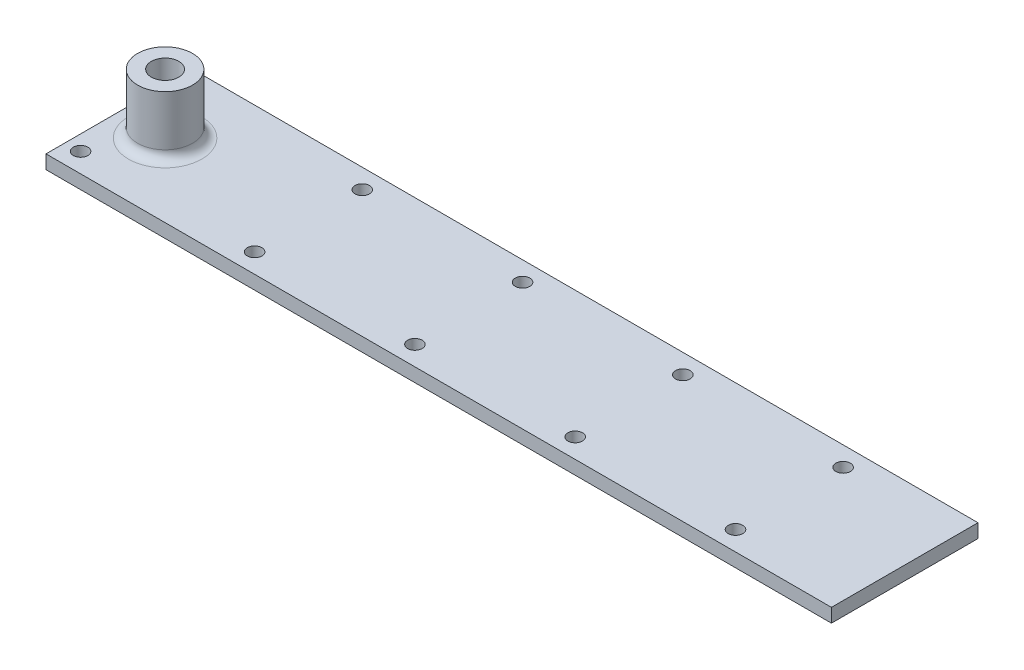
ISO-10303-21;
HEADER;
FILE_DESCRIPTION(('STEP AP214'),'2;1');
FILE_NAME('part.step','',(''),(''),'','','');
FILE_SCHEMA(('AUTOMOTIVE_DESIGN { 1 0 10303 214 1 1 1 1 }'));
ENDSEC;
DATA;
#1=APPLICATION_CONTEXT('core data for automotive mechanical design processes');
#2=APPLICATION_PROTOCOL_DEFINITION('international standard','automotive_design',2000,#1);
#3=PRODUCT_CONTEXT('',#1,'mechanical');
#4=PRODUCT('Part','Part','',(#3));
#5=PRODUCT_RELATED_PRODUCT_CATEGORY('part','',(#4));
#6=PRODUCT_DEFINITION_FORMATION('','',#4);
#7=PRODUCT_DEFINITION_CONTEXT('part definition',#1,'design');
#8=PRODUCT_DEFINITION('design','',#6,#7);
#9=PRODUCT_DEFINITION_SHAPE('','',#8);
#10=(LENGTH_UNIT() NAMED_UNIT(*) SI_UNIT(.MILLI.,.METRE.));
#11=(NAMED_UNIT(*) PLANE_ANGLE_UNIT() SI_UNIT($,.RADIAN.));
#12=(NAMED_UNIT(*) SI_UNIT($,.STERADIAN.) SOLID_ANGLE_UNIT());
#13=UNCERTAINTY_MEASURE_WITH_UNIT(LENGTH_MEASURE(1.E-05),#10,'distance_accuracy_value','');
#14=(GEOMETRIC_REPRESENTATION_CONTEXT(3) GLOBAL_UNCERTAINTY_ASSIGNED_CONTEXT((#13)) GLOBAL_UNIT_ASSIGNED_CONTEXT((#10,
#11,#12)) REPRESENTATION_CONTEXT('',''));
#15=CARTESIAN_POINT('',(0.,0.,0.));
#16=DIRECTION('',(0.,0.,1.));
#17=DIRECTION('',(1.,0.,0.));
#18=AXIS2_PLACEMENT_3D('',#15,#16,#17);
#19=CARTESIAN_POINT('',(0.,-13.,0.));
#20=DIRECTION('',(0.,1.,0.));
#21=DIRECTION('',(0.,0.,1.));
#22=AXIS2_PLACEMENT_3D('',#19,#20,#21);
#23=CYLINDRICAL_SURFACE('',#22,3.);
#24=CARTESIAN_POINT('',(0.,0.,0.));
#25=DIRECTION('',(0.,1.,0.));
#26=DIRECTION('',(0.,0.,1.));
#27=AXIS2_PLACEMENT_3D('',#24,#25,#26);
#28=CIRCLE('',#27,3.);
#29=CARTESIAN_POINT('',(0.,0.,3.));
#30=VERTEX_POINT('',#29);
#31=EDGE_CURVE('E376',#30,#30,#28,.T.);
#32=ORIENTED_EDGE('',*,*,#31,.T.);
#33=EDGE_LOOP('',(#32));
#34=FACE_BOUND('',#33,.T.);
#35=DIRECTION('',(0.,1.,0.));
#36=VECTOR('',#35,1.);
#37=CARTESIAN_POINT('',(1.5,-13.,2.59807621135332));
#38=LINE('',#37,#36);
#39=CARTESIAN_POINT('',(1.5,-11.3956567872682,2.59807621135332));
#40=VERTEX_POINT('',#39);
#41=CARTESIAN_POINT('',(1.5,-13.,2.59807621135332));
#42=VERTEX_POINT('',#41);
#43=EDGE_CURVE('E52',#40,#42,#38,.F.);
#44=ORIENTED_EDGE('',*,*,#43,.F.);
#45=CARTESIAN_POINT('',(0.,-11.3956567872682,0.));
#46=DIRECTION('',(0.,-1.,0.));
#47=DIRECTION('',(0.,0.,-1.));
#48=AXIS2_PLACEMENT_3D('',#45,#46,#47);
#49=CIRCLE('',#48,3.);
#50=CARTESIAN_POINT('',(0.,-11.3956567872682,3.00000000000001));
#51=VERTEX_POINT('',#50);
#52=EDGE_CURVE('E402',#51,#40,#49,.F.);
#53=ORIENTED_EDGE('',*,*,#52,.F.);
#54=CARTESIAN_POINT('',(-1.5,-11.3956567872682,2.59807621135332));
#55=VERTEX_POINT('',#54);
#56=EDGE_CURVE('E407',#55,#51,#49,.F.);
#57=ORIENTED_EDGE('',*,*,#56,.F.);
#58=DIRECTION('',(0.,1.,0.));
#59=VECTOR('',#58,1.);
#60=CARTESIAN_POINT('',(-1.5,-13.,2.59807621135332));
#61=LINE('',#60,#59);
#62=CARTESIAN_POINT('',(-1.5,-13.,2.59807621135332));
#63=VERTEX_POINT('',#62);
#64=EDGE_CURVE('E67',#55,#63,#61,.F.);
#65=ORIENTED_EDGE('',*,*,#64,.T.);
#66=CARTESIAN_POINT('',(0.,-13.,0.));
#67=DIRECTION('',(0.,1.,0.));
#68=DIRECTION('',(0.,0.,1.));
#69=AXIS2_PLACEMENT_3D('',#66,#67,#68);
#70=CIRCLE('',#69,3.);
#71=CARTESIAN_POINT('',(-1.5,-13.,-2.59807621135332));
#72=VERTEX_POINT('',#71);
#73=EDGE_CURVE('E387',#72,#63,#70,.T.);
#74=ORIENTED_EDGE('',*,*,#73,.F.);
#75=DIRECTION('',(0.,1.,0.));
#76=VECTOR('',#75,1.);
#77=CARTESIAN_POINT('',(-1.5,-13.,-2.59807621135332));
#78=LINE('',#77,#76);
#79=CARTESIAN_POINT('',(-1.5,-11.3956567872682,-2.59807621135332));
#80=VERTEX_POINT('',#79);
#81=EDGE_CURVE('E394',#72,#80,#78,.T.);
#82=ORIENTED_EDGE('',*,*,#81,.T.);
#83=CARTESIAN_POINT('',(0.,-11.3956567872682,-3.));
#84=VERTEX_POINT('',#83);
#85=EDGE_CURVE('E398',#84,#80,#49,.F.);
#86=ORIENTED_EDGE('',*,*,#85,.F.);
#87=CARTESIAN_POINT('',(1.5,-11.3956567872682,-2.59807621135332));
#88=VERTEX_POINT('',#87);
#89=EDGE_CURVE('E401',#88,#84,#49,.F.);
#90=ORIENTED_EDGE('',*,*,#89,.F.);
#91=DIRECTION('',(0.,1.,0.));
#92=VECTOR('',#91,1.);
#93=CARTESIAN_POINT('',(1.5,-13.,-2.59807621135332));
#94=LINE('',#93,#92);
#95=CARTESIAN_POINT('',(1.5,-13.,-2.59807621135332));
#96=VERTEX_POINT('',#95);
#97=EDGE_CURVE('E403',#96,#88,#94,.T.);
#98=ORIENTED_EDGE('',*,*,#97,.F.);
#99=EDGE_CURVE('E382',#42,#96,#70,.T.);
#100=ORIENTED_EDGE('',*,*,#99,.F.);
#101=EDGE_LOOP('',(#44,#53,#57,#65,#74,#82,#86,#90,#98,#100));
#102=FACE_BOUND('',#101,.T.);
#103=ADVANCED_FACE('F43',(#34,#102),#23,.F.);
#104=CARTESIAN_POINT('',(0.,-13.,0.));
#105=DIRECTION('',(0.,1.,0.));
#106=DIRECTION('',(0.,0.,1.));
#107=AXIS2_PLACEMENT_3D('',#104,#105,#106);
#108=CYLINDRICAL_SURFACE('',#107,6.);
#109=CARTESIAN_POINT('',(0.,-11.,0.));
#110=DIRECTION('',(0.,1.,0.));
#111=DIRECTION('',(0.,0.,1.));
#112=AXIS2_PLACEMENT_3D('',#109,#110,#111);
#113=CIRCLE('',#112,6.);
#114=CARTESIAN_POINT('',(0.,-11.,6.00000000000001));
#115=VERTEX_POINT('',#114);
#116=EDGE_CURVE('E11',#115,#115,#113,.F.);
#117=ORIENTED_EDGE('',*,*,#116,.F.);
#118=EDGE_LOOP('',(#117));
#119=FACE_BOUND('',#118,.T.);
#120=CARTESIAN_POINT('',(0.,0.,0.));
#121=DIRECTION('',(0.,1.,0.));
#122=DIRECTION('',(0.,0.,1.));
#123=AXIS2_PLACEMENT_3D('',#120,#121,#122);
#124=CIRCLE('',#123,6.);
#125=CARTESIAN_POINT('',(0.,0.,6.));
#126=VERTEX_POINT('',#125);
#127=EDGE_CURVE('E386',#126,#126,#124,.T.);
#128=ORIENTED_EDGE('',*,*,#127,.F.);
#129=EDGE_LOOP('',(#128));
#130=FACE_BOUND('',#129,.T.);
#131=ADVANCED_FACE('F45',(#119,#130),#108,.T.);
#132=CARTESIAN_POINT('',(0.,0.,0.));
#133=DIRECTION('',(0.,1.,0.));
#134=DIRECTION('',(0.,0.,1.));
#135=AXIS2_PLACEMENT_3D('',#132,#133,#134);
#136=PLANE('',#135);
#137=ORIENTED_EDGE('',*,*,#31,.F.);
#138=EDGE_LOOP('',(#137));
#139=FACE_BOUND('',#138,.T.);
#140=ORIENTED_EDGE('',*,*,#127,.T.);
#141=EDGE_LOOP('',(#140));
#142=FACE_BOUND('',#141,.T.);
#143=ADVANCED_FACE('F539',(#139,#142),#136,.T.);
#144=CARTESIAN_POINT('',(1.5,-11.3956567872682,0.));
#145=DIRECTION('',(0.,-1.,0.));
#146=DIRECTION('',(0.,0.,-1.));
#147=AXIS2_PLACEMENT_3D('',#144,#145,#146);
#148=PLANE('',#147);
#149=ORIENTED_EDGE('',*,*,#85,.T.);
#150=DIRECTION('',(0.,0.,1.));
#151=VECTOR('',#150,1.);
#152=CARTESIAN_POINT('',(-1.5,-11.3956567872682,0.));
#153=LINE('',#152,#151);
#154=CARTESIAN_POINT('',(-1.5,-11.3956567872682,-3.));
#155=VERTEX_POINT('',#154);
#156=EDGE_CURVE('E59',#155,#80,#153,.T.);
#157=ORIENTED_EDGE('',*,*,#156,.F.);
#158=DIRECTION('',(-1.,0.,0.));
#159=VECTOR('',#158,1.);
#160=CARTESIAN_POINT('',(1.5,-11.3956567872682,-3.));
#161=LINE('',#160,#159);
#162=EDGE_CURVE('E377',#84,#155,#161,.T.);
#163=ORIENTED_EDGE('',*,*,#162,.F.);
#164=EDGE_LOOP('',(#149,#157,#163));
#165=FACE_BOUND('',#164,.T.);
#166=ADVANCED_FACE('F428',(#165),#148,.T.);
#167=ORIENTED_EDGE('',*,*,#89,.T.);
#168=CARTESIAN_POINT('',(1.5,-11.3956567872682,-3.));
#169=VERTEX_POINT('',#168);
#170=EDGE_CURVE('E372',#169,#84,#161,.T.);
#171=ORIENTED_EDGE('',*,*,#170,.F.);
#172=DIRECTION('',(0.,0.,1.));
#173=VECTOR('',#172,1.);
#174=CARTESIAN_POINT('',(1.5,-11.3956567872682,0.));
#175=LINE('',#174,#173);
#176=EDGE_CURVE('E356',#169,#88,#175,.T.);
#177=ORIENTED_EDGE('',*,*,#176,.T.);
#178=EDGE_LOOP('',(#167,#171,#177));
#179=FACE_BOUND('',#178,.T.);
#180=ADVANCED_FACE('F424',(#179),#148,.T.);
#181=CARTESIAN_POINT('',(1.5,-11.3956567872682,-5.));
#182=DIRECTION('',(-1.,0.,0.));
#183=DIRECTION('',(0.,0.,1.));
#184=AXIS2_PLACEMENT_3D('',#181,#182,#183);
#185=CYLINDRICAL_SURFACE('',#184,2.);
#186=CARTESIAN_POINT('',(1.5,-11.3956567872682,-5.));
#187=DIRECTION('',(-1.,0.,0.));
#188=DIRECTION('',(0.,0.,1.));
#189=AXIS2_PLACEMENT_3D('',#186,#187,#188);
#190=CIRCLE('',#189,2.);
#191=CARTESIAN_POINT('',(1.5,-13.3480309076362,-4.5661390843627));
#192=VERTEX_POINT('',#191);
#193=EDGE_CURVE('E360',#169,#192,#190,.F.);
#194=ORIENTED_EDGE('',*,*,#193,.F.);
#195=ORIENTED_EDGE('',*,*,#170,.T.);
#196=ORIENTED_EDGE('',*,*,#162,.T.);
#197=CARTESIAN_POINT('',(-1.5,-11.3956567872682,-5.));
#198=DIRECTION('',(-1.,0.,0.));
#199=DIRECTION('',(0.,0.,1.));
#200=AXIS2_PLACEMENT_3D('',#197,#198,#199);
#201=CIRCLE('',#200,2.);
#202=CARTESIAN_POINT('',(-1.5,-13.3480309076362,-4.5661390843627));
#203=VERTEX_POINT('',#202);
#204=EDGE_CURVE('E355',#155,#203,#201,.F.);
#205=ORIENTED_EDGE('',*,*,#204,.T.);
#206=DIRECTION('',(-1.,0.,0.));
#207=VECTOR('',#206,1.);
#208=CARTESIAN_POINT('',(1.5,-13.3480309076362,-4.5661390843627));
#209=LINE('',#208,#207);
#210=EDGE_CURVE('E451',#192,#203,#209,.T.);
#211=ORIENTED_EDGE('',*,*,#210,.F.);
#212=EDGE_LOOP('',(#194,#195,#196,#205,#211));
#213=FACE_BOUND('',#212,.T.);
#214=ADVANCED_FACE('F432',(#213),#185,.T.);
#215=CARTESIAN_POINT('',(1.5,-11.3956567872682,5.));
#216=DIRECTION('',(-1.,0.,0.));
#217=DIRECTION('',(0.,0.,1.));
#218=AXIS2_PLACEMENT_3D('',#215,#216,#217);
#219=CYLINDRICAL_SURFACE('',#218,1.99999999999999);
#220=CARTESIAN_POINT('',(-1.5,-11.3956567872682,5.));
#221=DIRECTION('',(-1.,0.,0.));
#222=DIRECTION('',(0.,0.,1.));
#223=AXIS2_PLACEMENT_3D('',#220,#221,#222);
#224=CIRCLE('',#223,1.99999999999999);
#225=CARTESIAN_POINT('',(-1.5,-13.3480309076361,4.56613908436271));
#226=VERTEX_POINT('',#225);
#227=CARTESIAN_POINT('',(-1.5,-11.3956567872682,3.00000000000001));
#228=VERTEX_POINT('',#227);
#229=EDGE_CURVE('E350',#226,#228,#224,.F.);
#230=ORIENTED_EDGE('',*,*,#229,.T.);
#231=DIRECTION('',(-1.,0.,0.));
#232=VECTOR('',#231,1.);
#233=CARTESIAN_POINT('',(1.5,-11.3956567872682,3.00000000000001));
#234=LINE('',#233,#232);
#235=EDGE_CURVE('E363',#51,#228,#234,.T.);
#236=ORIENTED_EDGE('',*,*,#235,.F.);
#237=CARTESIAN_POINT('',(1.5,-11.3956567872682,3.00000000000001));
#238=VERTEX_POINT('',#237);
#239=EDGE_CURVE('E378',#238,#51,#234,.T.);
#240=ORIENTED_EDGE('',*,*,#239,.F.);
#241=CARTESIAN_POINT('',(1.5,-11.3956567872682,5.));
#242=DIRECTION('',(-1.,0.,0.));
#243=DIRECTION('',(0.,0.,1.));
#244=AXIS2_PLACEMENT_3D('',#241,#242,#243);
#245=CIRCLE('',#244,1.99999999999999);
#246=CARTESIAN_POINT('',(1.5,-13.3480309076361,4.56613908436271));
#247=VERTEX_POINT('',#246);
#248=EDGE_CURVE('E351',#247,#238,#245,.F.);
#249=ORIENTED_EDGE('',*,*,#248,.F.);
#250=DIRECTION('',(-1.,0.,0.));
#251=VECTOR('',#250,1.);
#252=CARTESIAN_POINT('',(1.5,-13.3480309076361,4.56613908436271));
#253=LINE('',#252,#251);
#254=EDGE_CURVE('E455',#247,#226,#253,.T.);
#255=ORIENTED_EDGE('',*,*,#254,.T.);
#256=EDGE_LOOP('',(#230,#236,#240,#249,#255));
#257=FACE_BOUND('',#256,.T.);
#258=ADVANCED_FACE('F505',(#257),#219,.T.);
#259=ORIENTED_EDGE('',*,*,#56,.T.);
#260=ORIENTED_EDGE('',*,*,#235,.T.);
#261=EDGE_CURVE('E367',#55,#228,#153,.T.);
#262=ORIENTED_EDGE('',*,*,#261,.F.);
#263=EDGE_LOOP('',(#259,#260,#262));
#264=FACE_BOUND('',#263,.T.);
#265=ADVANCED_FACE('F555',(#264),#148,.T.);
#266=ORIENTED_EDGE('',*,*,#52,.T.);
#267=EDGE_CURVE('E354',#40,#238,#175,.T.);
#268=ORIENTED_EDGE('',*,*,#267,.T.);
#269=ORIENTED_EDGE('',*,*,#239,.T.);
#270=EDGE_LOOP('',(#266,#268,#269));
#271=FACE_BOUND('',#270,.T.);
#272=ADVANCED_FACE('F507',(#271),#148,.T.);
#273=CARTESIAN_POINT('',(1.5,0.,0.));
#274=DIRECTION('',(-1.,0.,0.));
#275=DIRECTION('',(0.,0.,1.));
#276=AXIS2_PLACEMENT_3D('',#273,#274,#275);
#277=PLANE('',#276);
#278=ORIENTED_EDGE('',*,*,#43,.T.);
#279=DIRECTION('',(0.,0.,-1.));
#280=VECTOR('',#279,1.);
#281=CARTESIAN_POINT('',(1.5,-13.,0.));
#282=LINE('',#281,#280);
#283=EDGE_CURVE('E342',#42,#96,#282,.T.);
#284=ORIENTED_EDGE('',*,*,#283,.T.);
#285=ORIENTED_EDGE('',*,*,#97,.T.);
#286=ORIENTED_EDGE('',*,*,#176,.F.);
#287=ORIENTED_EDGE('',*,*,#193,.T.);
#288=DIRECTION('',(0.,-0.216930457818655,-0.976187060183953));
#289=VECTOR('',#288,1.);
#290=CARTESIAN_POINT('',(1.5,-11.7529411764706,2.61176470588234));
#291=LINE('',#290,#289);
#292=CARTESIAN_POINT('',(1.5,-13.6519690923638,-5.93386091563729));
#293=VERTEX_POINT('',#292);
#294=EDGE_CURVE('E490',#192,#293,#291,.T.);
#295=ORIENTED_EDGE('',*,*,#294,.T.);
#296=CARTESIAN_POINT('',(1.5,-15.6043432127317,-5.49999999999999));
#297=DIRECTION('',(-1.,0.,0.));
#298=DIRECTION('',(0.,0.,1.));
#299=AXIS2_PLACEMENT_3D('',#296,#297,#298);
#300=CIRCLE('',#299,2.);
#301=CARTESIAN_POINT('',(1.5,-15.6043432127318,-7.49999999999999));
#302=VERTEX_POINT('',#301);
#303=EDGE_CURVE('E211',#293,#302,#300,.T.);
#304=ORIENTED_EDGE('',*,*,#303,.T.);
#305=DIRECTION('',(0.,-1.,0.));
#306=VECTOR('',#305,1.);
#307=CARTESIAN_POINT('',(1.5,0.,-7.50000000000002));
#308=LINE('',#307,#306);
#309=CARTESIAN_POINT('',(1.5,-16.,-7.49999999999999));
#310=VERTEX_POINT('',#309);
#311=EDGE_CURVE('E197',#302,#310,#308,.T.);
#312=ORIENTED_EDGE('',*,*,#311,.T.);
#313=DIRECTION('',(0.,0.,1.));
#314=VECTOR('',#313,1.);
#315=CARTESIAN_POINT('',(1.5,-16.,0.));
#316=LINE('',#315,#314);
#317=CARTESIAN_POINT('',(1.5,-16.,7.50000000000001));
#318=VERTEX_POINT('',#317);
#319=EDGE_CURVE('E190',#310,#318,#316,.T.);
#320=ORIENTED_EDGE('',*,*,#319,.T.);
#321=DIRECTION('',(0.,-1.,0.));
#322=VECTOR('',#321,1.);
#323=CARTESIAN_POINT('',(1.5,0.,7.49999999999997));
#324=LINE('',#323,#322);
#325=CARTESIAN_POINT('',(1.5,-15.6043432127317,7.50000000000001));
#326=VERTEX_POINT('',#325);
#327=EDGE_CURVE('E177',#326,#318,#324,.T.);
#328=ORIENTED_EDGE('',*,*,#327,.F.);
#329=CARTESIAN_POINT('',(1.5,-15.6043432127317,5.50000000000001));
#330=DIRECTION('',(-1.,0.,0.));
#331=DIRECTION('',(0.,0.,1.));
#332=AXIS2_PLACEMENT_3D('',#329,#330,#331);
#333=CIRCLE('',#332,2.);
#334=CARTESIAN_POINT('',(1.5,-13.6519690923638,5.93386091563732));
#335=VERTEX_POINT('',#334);
#336=EDGE_CURVE('E189',#326,#335,#333,.T.);
#337=ORIENTED_EDGE('',*,*,#336,.T.);
#338=DIRECTION('',(0.,-0.216930457818655,0.976187060183953));
#339=VECTOR('',#338,1.);
#340=CARTESIAN_POINT('',(1.5,-11.7529411764706,-2.61176470588234));
#341=LINE('',#340,#339);
#342=EDGE_CURVE('E494',#247,#335,#341,.T.);
#343=ORIENTED_EDGE('',*,*,#342,.F.);
#344=ORIENTED_EDGE('',*,*,#248,.T.);
#345=ORIENTED_EDGE('',*,*,#267,.F.);
#346=EDGE_LOOP('',(#278,#284,#285,#286,#287,#295,#304,#312,#320,#328,#337,#343,#344,#345));
#347=FACE_BOUND('',#346,.T.);
#348=ADVANCED_FACE('F194',(#347),#277,.T.);
#349=CARTESIAN_POINT('',(-1.5,0.,0.));
#350=DIRECTION('',(-1.,0.,0.));
#351=DIRECTION('',(0.,0.,1.));
#352=AXIS2_PLACEMENT_3D('',#349,#350,#351);
#353=PLANE('',#352);
#354=ORIENTED_EDGE('',*,*,#64,.F.);
#355=ORIENTED_EDGE('',*,*,#261,.T.);
#356=ORIENTED_EDGE('',*,*,#229,.F.);
#357=DIRECTION('',(0.,-0.216930457818655,0.976187060183953));
#358=VECTOR('',#357,1.);
#359=CARTESIAN_POINT('',(-1.5,-11.7529411764706,-2.61176470588234));
#360=LINE('',#359,#358);
#361=CARTESIAN_POINT('',(-1.5,-13.6519690923638,5.93386091563732));
#362=VERTEX_POINT('',#361);
#363=EDGE_CURVE('E476',#226,#362,#360,.T.);
#364=ORIENTED_EDGE('',*,*,#363,.T.);
#365=CARTESIAN_POINT('',(-1.5,-15.6043432127317,5.50000000000001));
#366=DIRECTION('',(-1.,0.,0.));
#367=DIRECTION('',(0.,0.,1.));
#368=AXIS2_PLACEMENT_3D('',#365,#366,#367);
#369=CIRCLE('',#368,2.);
#370=CARTESIAN_POINT('',(-1.5,-15.6043432127317,7.50000000000001));
#371=VERTEX_POINT('',#370);
#372=EDGE_CURVE('E479',#371,#362,#369,.T.);
#373=ORIENTED_EDGE('',*,*,#372,.F.);
#374=DIRECTION('',(0.,-1.,0.));
#375=VECTOR('',#374,1.);
#376=CARTESIAN_POINT('',(-1.5,0.,7.49999999999997));
#377=LINE('',#376,#375);
#378=CARTESIAN_POINT('',(-1.5,-16.,7.50000000000001));
#379=VERTEX_POINT('',#378);
#380=EDGE_CURVE('E483',#371,#379,#377,.T.);
#381=ORIENTED_EDGE('',*,*,#380,.T.);
#382=DIRECTION('',(0.,0.,1.));
#383=VECTOR('',#382,1.);
#384=CARTESIAN_POINT('',(-1.5,-16.,0.));
#385=LINE('',#384,#383);
#386=CARTESIAN_POINT('',(-1.5,-16.,-7.49999999999999));
#387=VERTEX_POINT('',#386);
#388=EDGE_CURVE('E204',#387,#379,#385,.T.);
#389=ORIENTED_EDGE('',*,*,#388,.F.);
#390=DIRECTION('',(0.,-1.,0.));
#391=VECTOR('',#390,1.);
#392=CARTESIAN_POINT('',(-1.5,0.,-7.50000000000002));
#393=LINE('',#392,#391);
#394=CARTESIAN_POINT('',(-1.5,-15.6043432127318,-7.49999999999999));
#395=VERTEX_POINT('',#394);
#396=EDGE_CURVE('E201',#395,#387,#393,.T.);
#397=ORIENTED_EDGE('',*,*,#396,.F.);
#398=CARTESIAN_POINT('',(-1.5,-15.6043432127317,-5.49999999999999));
#399=DIRECTION('',(-1.,0.,0.));
#400=DIRECTION('',(0.,0.,1.));
#401=AXIS2_PLACEMENT_3D('',#398,#399,#400);
#402=CIRCLE('',#401,2.);
#403=CARTESIAN_POINT('',(-1.5,-13.6519690923638,-5.93386091563729));
#404=VERTEX_POINT('',#403);
#405=EDGE_CURVE('E468',#404,#395,#402,.T.);
#406=ORIENTED_EDGE('',*,*,#405,.F.);
#407=DIRECTION('',(0.,-0.216930457818655,-0.976187060183953));
#408=VECTOR('',#407,1.);
#409=CARTESIAN_POINT('',(-1.5,-11.7529411764706,2.61176470588234));
#410=LINE('',#409,#408);
#411=EDGE_CURVE('E472',#203,#404,#410,.T.);
#412=ORIENTED_EDGE('',*,*,#411,.F.);
#413=ORIENTED_EDGE('',*,*,#204,.F.);
#414=ORIENTED_EDGE('',*,*,#156,.T.);
#415=ORIENTED_EDGE('',*,*,#81,.F.);
#416=DIRECTION('',(0.,0.,-1.));
#417=VECTOR('',#416,1.);
#418=CARTESIAN_POINT('',(-1.5,-13.,0.));
#419=LINE('',#418,#417);
#420=EDGE_CURVE('E338',#63,#72,#419,.T.);
#421=ORIENTED_EDGE('',*,*,#420,.F.);
#422=EDGE_LOOP('',(#354,#355,#356,#364,#373,#381,#389,#397,#406,#412,#413,#414,#415,#421));
#423=FACE_BOUND('',#422,.T.);
#424=ADVANCED_FACE('F435',(#423),#353,.F.);
#425=CARTESIAN_POINT('',(0.,-11.,0.));
#426=DIRECTION('',(0.,1.,0.));
#427=DIRECTION('',(0.,0.,1.));
#428=AXIS2_PLACEMENT_3D('',#425,#426,#427);
#429=TOROIDAL_SURFACE('',#428,8.,1.99999999999999);
#430=CARTESIAN_POINT('',(0.,-13.,0.));
#431=DIRECTION('',(0.,1.,0.));
#432=DIRECTION('',(0.,0.,1.));
#433=AXIS2_PLACEMENT_3D('',#430,#431,#432);
#434=CIRCLE('',#433,8.);
#435=CARTESIAN_POINT('',(0.,-13.,8.00000000000001));
#436=VERTEX_POINT('',#435);
#437=EDGE_CURVE('E346',#436,#436,#434,.T.);
#438=ORIENTED_EDGE('',*,*,#437,.T.);
#439=EDGE_LOOP('',(#438));
#440=FACE_BOUND('',#439,.T.);
#441=ORIENTED_EDGE('',*,*,#116,.T.);
#442=EDGE_LOOP('',(#441));
#443=FACE_BOUND('',#442,.T.);
#444=ADVANCED_FACE('F573',(#440,#443),#429,.F.);
#445=CARTESIAN_POINT('',(0.,-13.,0.));
#446=DIRECTION('',(0.,-1.,0.));
#447=DIRECTION('',(0.,0.,-1.));
#448=AXIS2_PLACEMENT_3D('',#445,#446,#447);
#449=PLANE('',#448);
#450=ORIENTED_EDGE('',*,*,#420,.T.);
#451=ORIENTED_EDGE('',*,*,#73,.T.);
#452=EDGE_LOOP('',(#450,#451));
#453=FACE_BOUND('',#452,.T.);
#454=ADVANCED_FACE('F438',(#453),#449,.F.);
#455=ORIENTED_EDGE('',*,*,#283,.F.);
#456=ORIENTED_EDGE('',*,*,#99,.T.);
#457=EDGE_LOOP('',(#455,#456));
#458=FACE_BOUND('',#457,.T.);
#459=ADVANCED_FACE('F510',(#458),#449,.F.);
#460=CARTESIAN_POINT('',(0.,-16.,0.));
#461=DIRECTION('',(0.,-1.,0.));
#462=DIRECTION('',(0.,0.,-1.));
#463=AXIS2_PLACEMENT_3D('',#460,#461,#462);
#464=PLANE('',#463);
#465=CARTESIAN_POINT('',(31.3,-16.,11.75));
#466=DIRECTION('',(0.,-1.,0.));
#467=DIRECTION('',(0.,0.,1.));
#468=AXIS2_PLACEMENT_3D('',#465,#466,#467);
#469=CIRCLE('',#468,1.58749999999998);
#470=CARTESIAN_POINT('',(31.3,-16.,13.3375));
#471=VERTEX_POINT('',#470);
#472=EDGE_CURVE('E225',#471,#471,#469,.T.);
#473=ORIENTED_EDGE('',*,*,#472,.F.);
#474=EDGE_LOOP('',(#473));
#475=FACE_BOUND('',#474,.T.);
#476=CARTESIAN_POINT('',(101.3,-16.,11.75));
#477=DIRECTION('',(0.,-1.,0.));
#478=DIRECTION('',(0.,0.,1.));
#479=AXIS2_PLACEMENT_3D('',#476,#477,#478);
#480=CIRCLE('',#479,1.58749999999998);
#481=CARTESIAN_POINT('',(101.3,-16.,13.3375));
#482=VERTEX_POINT('',#481);
#483=EDGE_CURVE('E241',#482,#482,#480,.T.);
#484=ORIENTED_EDGE('',*,*,#483,.F.);
#485=EDGE_LOOP('',(#484));
#486=FACE_BOUND('',#485,.T.);
#487=CARTESIAN_POINT('',(66.3,-16.,-11.75));
#488=DIRECTION('',(0.,-1.,0.));
#489=DIRECTION('',(0.,0.,-1.));
#490=AXIS2_PLACEMENT_3D('',#487,#488,#489);
#491=CIRCLE('',#490,1.58749999999998);
#492=CARTESIAN_POINT('',(66.3,-16.,-13.3375));
#493=VERTEX_POINT('',#492);
#494=EDGE_CURVE('E257',#493,#493,#491,.T.);
#495=ORIENTED_EDGE('',*,*,#494,.F.);
#496=EDGE_LOOP('',(#495));
#497=FACE_BOUND('',#496,.T.);
#498=CARTESIAN_POINT('',(-6.7,-16.,11.75));
#499=DIRECTION('',(0.,-1.,0.));
#500=DIRECTION('',(0.,0.,-1.));
#501=AXIS2_PLACEMENT_3D('',#498,#499,#500);
#502=CIRCLE('',#501,1.5875);
#503=CARTESIAN_POINT('',(-6.7,-16.,10.1625));
#504=VERTEX_POINT('',#503);
#505=EDGE_CURVE('E273',#504,#504,#502,.T.);
#506=ORIENTED_EDGE('',*,*,#505,.F.);
#507=EDGE_LOOP('',(#506));
#508=FACE_BOUND('',#507,.T.);
#509=CARTESIAN_POINT('',(136.3,-16.,-11.75));
#510=DIRECTION('',(0.,-1.,0.));
#511=DIRECTION('',(0.,0.,-1.));
#512=AXIS2_PLACEMENT_3D('',#509,#510,#511);
#513=CIRCLE('',#512,1.58749999999998);
#514=CARTESIAN_POINT('',(136.3,-16.,-13.3375));
#515=VERTEX_POINT('',#514);
#516=EDGE_CURVE('E289',#515,#515,#513,.T.);
#517=ORIENTED_EDGE('',*,*,#516,.F.);
#518=EDGE_LOOP('',(#517));
#519=FACE_BOUND('',#518,.T.);
#520=DIRECTION('',(0.,0.,-1.));
#521=VECTOR('',#520,1.);
#522=CARTESIAN_POINT('',(-10.,-16.,16.));
#523=LINE('',#522,#521);
#524=CARTESIAN_POINT('',(-10.,-16.,16.));
#525=VERTEX_POINT('',#524);
#526=CARTESIAN_POINT('',(-10.,-16.,-16.));
#527=VERTEX_POINT('',#526);
#528=EDGE_CURVE('E297',#525,#527,#523,.T.);
#529=ORIENTED_EDGE('',*,*,#528,.T.);
#530=DIRECTION('',(1.,0.,0.));
#531=VECTOR('',#530,1.);
#532=CARTESIAN_POINT('',(-10.,-16.,-16.));
#533=LINE('',#532,#531);
#534=CARTESIAN_POINT('',(161.5,-16.,-16.));
#535=VERTEX_POINT('',#534);
#536=EDGE_CURVE('E301',#527,#535,#533,.T.);
#537=ORIENTED_EDGE('',*,*,#536,.T.);
#538=DIRECTION('',(0.,0.,1.));
#539=VECTOR('',#538,1.);
#540=CARTESIAN_POINT('',(161.5,-16.,16.));
#541=LINE('',#540,#539);
#542=CARTESIAN_POINT('',(161.5,-16.,16.));
#543=VERTEX_POINT('',#542);
#544=EDGE_CURVE('E305',#535,#543,#541,.T.);
#545=ORIENTED_EDGE('',*,*,#544,.T.);
#546=DIRECTION('',(-1.,0.,0.));
#547=VECTOR('',#546,1.);
#548=CARTESIAN_POINT('',(-10.,-16.,16.));
#549=LINE('',#548,#547);
#550=EDGE_CURVE('E308',#543,#525,#549,.T.);
#551=ORIENTED_EDGE('',*,*,#550,.T.);
#552=EDGE_LOOP('',(#529,#537,#545,#551));
#553=FACE_BOUND('',#552,.T.);
#554=CARTESIAN_POINT('',(136.3,-16.,11.75));
#555=DIRECTION('',(0.,-1.,0.));
#556=DIRECTION('',(0.,0.,1.));
#557=AXIS2_PLACEMENT_3D('',#554,#555,#556);
#558=CIRCLE('',#557,1.58749999999998);
#559=CARTESIAN_POINT('',(136.3,-16.,13.3375));
#560=VERTEX_POINT('',#559);
#561=EDGE_CURVE('E281',#560,#560,#558,.T.);
#562=ORIENTED_EDGE('',*,*,#561,.F.);
#563=EDGE_LOOP('',(#562));
#564=FACE_BOUND('',#563,.T.);
#565=CARTESIAN_POINT('',(101.3,-16.,-11.75));
#566=DIRECTION('',(0.,-1.,0.));
#567=DIRECTION('',(0.,0.,-1.));
#568=AXIS2_PLACEMENT_3D('',#565,#566,#567);
#569=CIRCLE('',#568,1.58749999999998);
#570=CARTESIAN_POINT('',(101.3,-16.,-13.3375));
#571=VERTEX_POINT('',#570);
#572=EDGE_CURVE('E265',#571,#571,#569,.T.);
#573=ORIENTED_EDGE('',*,*,#572,.F.);
#574=EDGE_LOOP('',(#573));
#575=FACE_BOUND('',#574,.T.);
#576=CARTESIAN_POINT('',(31.3,-16.,-11.75));
#577=DIRECTION('',(0.,-1.,0.));
#578=DIRECTION('',(0.,0.,-1.));
#579=AXIS2_PLACEMENT_3D('',#576,#577,#578);
#580=CIRCLE('',#579,1.58749999999998);
#581=CARTESIAN_POINT('',(31.3,-16.,-13.3375));
#582=VERTEX_POINT('',#581);
#583=EDGE_CURVE('E249',#582,#582,#580,.T.);
#584=ORIENTED_EDGE('',*,*,#583,.F.);
#585=EDGE_LOOP('',(#584));
#586=FACE_BOUND('',#585,.T.);
#587=CARTESIAN_POINT('',(66.3,-16.,11.75));
#588=DIRECTION('',(0.,-1.,0.));
#589=DIRECTION('',(0.,0.,1.));
#590=AXIS2_PLACEMENT_3D('',#587,#588,#589);
#591=CIRCLE('',#590,1.58749999999998);
#592=CARTESIAN_POINT('',(66.3,-16.,13.3375));
#593=VERTEX_POINT('',#592);
#594=EDGE_CURVE('E233',#593,#593,#591,.T.);
#595=ORIENTED_EDGE('',*,*,#594,.F.);
#596=EDGE_LOOP('',(#595));
#597=FACE_BOUND('',#596,.T.);
#598=CARTESIAN_POINT('',(-6.7,-16.,-11.75));
#599=DIRECTION('',(0.,-1.,0.));
#600=DIRECTION('',(0.,0.,1.));
#601=AXIS2_PLACEMENT_3D('',#598,#599,#600);
#602=CIRCLE('',#601,1.5875);
#603=CARTESIAN_POINT('',(-6.7,-16.,-10.1625));
#604=VERTEX_POINT('',#603);
#605=EDGE_CURVE('E215',#604,#604,#602,.T.);
#606=ORIENTED_EDGE('',*,*,#605,.F.);
#607=EDGE_LOOP('',(#606));
#608=FACE_BOUND('',#607,.T.);
#609=DIRECTION('',(-1.,0.,0.));
#610=VECTOR('',#609,1.);
#611=CARTESIAN_POINT('',(1.5,-16.,7.50000000000001));
#612=LINE('',#611,#610);
#613=EDGE_CURVE('E182',#318,#379,#612,.T.);
#614=ORIENTED_EDGE('',*,*,#613,.F.);
#615=ORIENTED_EDGE('',*,*,#319,.F.);
#616=DIRECTION('',(-1.,0.,0.));
#617=VECTOR('',#616,1.);
#618=CARTESIAN_POINT('',(1.5,-16.,-7.49999999999999));
#619=LINE('',#618,#617);
#620=EDGE_CURVE('E224',#310,#387,#619,.T.);
#621=ORIENTED_EDGE('',*,*,#620,.T.);
#622=ORIENTED_EDGE('',*,*,#388,.T.);
#623=EDGE_LOOP('',(#614,#615,#621,#622));
#624=FACE_BOUND('',#623,.T.);
#625=ADVANCED_FACE('F203',(#475,#486,#497,#508,#519,#553,#564,#575,#586,#597,#608,#624),#464,.T.);
#626=ORIENTED_EDGE('',*,*,#437,.F.);
#627=EDGE_LOOP('',(#626));
#628=FACE_BOUND('',#627,.T.);
#629=CARTESIAN_POINT('',(-6.7,-13.,-11.75));
#630=DIRECTION('',(0.,-1.,0.));
#631=DIRECTION('',(0.,0.,1.));
#632=AXIS2_PLACEMENT_3D('',#629,#630,#631);
#633=CIRCLE('',#632,1.5875);
#634=CARTESIAN_POINT('',(-6.7,-13.,-10.1625));
#635=VERTEX_POINT('',#634);
#636=EDGE_CURVE('E220',#635,#635,#633,.T.);
#637=ORIENTED_EDGE('',*,*,#636,.T.);
#638=EDGE_LOOP('',(#637));
#639=FACE_BOUND('',#638,.T.);
#640=CARTESIAN_POINT('',(31.3,-13.,11.75));
#641=DIRECTION('',(0.,-1.,0.));
#642=DIRECTION('',(0.,0.,1.));
#643=AXIS2_PLACEMENT_3D('',#640,#641,#642);
#644=CIRCLE('',#643,1.58749999999998);
#645=CARTESIAN_POINT('',(31.3,-13.,13.3375));
#646=VERTEX_POINT('',#645);
#647=EDGE_CURVE('E219',#646,#646,#644,.T.);
#648=ORIENTED_EDGE('',*,*,#647,.T.);
#649=EDGE_LOOP('',(#648));
#650=FACE_BOUND('',#649,.T.);
#651=CARTESIAN_POINT('',(66.3,-13.,11.75));
#652=DIRECTION('',(0.,-1.,0.));
#653=DIRECTION('',(0.,0.,1.));
#654=AXIS2_PLACEMENT_3D('',#651,#652,#653);
#655=CIRCLE('',#654,1.58749999999998);
#656=CARTESIAN_POINT('',(66.3,-13.,13.3375));
#657=VERTEX_POINT('',#656);
#658=EDGE_CURVE('E229',#657,#657,#655,.T.);
#659=ORIENTED_EDGE('',*,*,#658,.T.);
#660=EDGE_LOOP('',(#659));
#661=FACE_BOUND('',#660,.T.);
#662=CARTESIAN_POINT('',(101.3,-13.,11.75));
#663=DIRECTION('',(0.,-1.,0.));
#664=DIRECTION('',(0.,0.,1.));
#665=AXIS2_PLACEMENT_3D('',#662,#663,#664);
#666=CIRCLE('',#665,1.58749999999998);
#667=CARTESIAN_POINT('',(101.3,-13.,13.3375));
#668=VERTEX_POINT('',#667);
#669=EDGE_CURVE('E237',#668,#668,#666,.T.);
#670=ORIENTED_EDGE('',*,*,#669,.T.);
#671=EDGE_LOOP('',(#670));
#672=FACE_BOUND('',#671,.T.);
#673=CARTESIAN_POINT('',(31.3,-13.,-11.75));
#674=DIRECTION('',(0.,-1.,0.));
#675=DIRECTION('',(0.,0.,-1.));
#676=AXIS2_PLACEMENT_3D('',#673,#674,#675);
#677=CIRCLE('',#676,1.58749999999998);
#678=CARTESIAN_POINT('',(31.3,-13.,-13.3375));
#679=VERTEX_POINT('',#678);
#680=EDGE_CURVE('E245',#679,#679,#677,.T.);
#681=ORIENTED_EDGE('',*,*,#680,.T.);
#682=EDGE_LOOP('',(#681));
#683=FACE_BOUND('',#682,.T.);
#684=CARTESIAN_POINT('',(66.3,-13.,-11.75));
#685=DIRECTION('',(0.,-1.,0.));
#686=DIRECTION('',(0.,0.,-1.));
#687=AXIS2_PLACEMENT_3D('',#684,#685,#686);
#688=CIRCLE('',#687,1.58749999999998);
#689=CARTESIAN_POINT('',(66.3,-13.,-13.3375));
#690=VERTEX_POINT('',#689);
#691=EDGE_CURVE('E253',#690,#690,#688,.T.);
#692=ORIENTED_EDGE('',*,*,#691,.T.);
#693=EDGE_LOOP('',(#692));
#694=FACE_BOUND('',#693,.T.);
#695=CARTESIAN_POINT('',(101.3,-13.,-11.75));
#696=DIRECTION('',(0.,-1.,0.));
#697=DIRECTION('',(0.,0.,-1.));
#698=AXIS2_PLACEMENT_3D('',#695,#696,#697);
#699=CIRCLE('',#698,1.58749999999998);
#700=CARTESIAN_POINT('',(101.3,-13.,-13.3375));
#701=VERTEX_POINT('',#700);
#702=EDGE_CURVE('E261',#701,#701,#699,.T.);
#703=ORIENTED_EDGE('',*,*,#702,.T.);
#704=EDGE_LOOP('',(#703));
#705=FACE_BOUND('',#704,.T.);
#706=CARTESIAN_POINT('',(-6.7,-13.,11.75));
#707=DIRECTION('',(0.,-1.,0.));
#708=DIRECTION('',(0.,0.,-1.));
#709=AXIS2_PLACEMENT_3D('',#706,#707,#708);
#710=CIRCLE('',#709,1.5875);
#711=CARTESIAN_POINT('',(-6.7,-13.,10.1625));
#712=VERTEX_POINT('',#711);
#713=EDGE_CURVE('E269',#712,#712,#710,.T.);
#714=ORIENTED_EDGE('',*,*,#713,.T.);
#715=EDGE_LOOP('',(#714));
#716=FACE_BOUND('',#715,.T.);
#717=CARTESIAN_POINT('',(136.3,-13.,11.75));
#718=DIRECTION('',(0.,-1.,0.));
#719=DIRECTION('',(0.,0.,1.));
#720=AXIS2_PLACEMENT_3D('',#717,#718,#719);
#721=CIRCLE('',#720,1.58749999999998);
#722=CARTESIAN_POINT('',(136.3,-13.,13.3375));
#723=VERTEX_POINT('',#722);
#724=EDGE_CURVE('E277',#723,#723,#721,.T.);
#725=ORIENTED_EDGE('',*,*,#724,.T.);
#726=EDGE_LOOP('',(#725));
#727=FACE_BOUND('',#726,.T.);
#728=CARTESIAN_POINT('',(136.3,-13.,-11.75));
#729=DIRECTION('',(0.,-1.,0.));
#730=DIRECTION('',(0.,0.,-1.));
#731=AXIS2_PLACEMENT_3D('',#728,#729,#730);
#732=CIRCLE('',#731,1.58749999999998);
#733=CARTESIAN_POINT('',(136.3,-13.,-13.3375));
#734=VERTEX_POINT('',#733);
#735=EDGE_CURVE('E285',#734,#734,#732,.T.);
#736=ORIENTED_EDGE('',*,*,#735,.T.);
#737=EDGE_LOOP('',(#736));
#738=FACE_BOUND('',#737,.T.);
#739=DIRECTION('',(0.,0.,-1.));
#740=VECTOR('',#739,1.);
#741=CARTESIAN_POINT('',(-10.,-13.,16.));
#742=LINE('',#741,#740);
#743=CARTESIAN_POINT('',(-10.,-13.,16.));
#744=VERTEX_POINT('',#743);
#745=CARTESIAN_POINT('',(-10.,-13.,-16.));
#746=VERTEX_POINT('',#745);
#747=EDGE_CURVE('E293',#744,#746,#742,.T.);
#748=ORIENTED_EDGE('',*,*,#747,.F.);
#749=DIRECTION('',(-1.,0.,0.));
#750=VECTOR('',#749,1.);
#751=CARTESIAN_POINT('',(-10.,-13.,16.));
#752=LINE('',#751,#750);
#753=CARTESIAN_POINT('',(161.5,-13.,16.));
#754=VERTEX_POINT('',#753);
#755=EDGE_CURVE('E302',#754,#744,#752,.T.);
#756=ORIENTED_EDGE('',*,*,#755,.F.);
#757=DIRECTION('',(0.,0.,1.));
#758=VECTOR('',#757,1.);
#759=CARTESIAN_POINT('',(161.5,-13.,16.));
#760=LINE('',#759,#758);
#761=CARTESIAN_POINT('',(161.5,-13.,-16.));
#762=VERTEX_POINT('',#761);
#763=EDGE_CURVE('E318',#762,#754,#760,.T.);
#764=ORIENTED_EDGE('',*,*,#763,.F.);
#765=DIRECTION('',(1.,0.,0.));
#766=VECTOR('',#765,1.);
#767=CARTESIAN_POINT('',(-10.,-13.,-16.));
#768=LINE('',#767,#766);
#769=EDGE_CURVE('E315',#746,#762,#768,.T.);
#770=ORIENTED_EDGE('',*,*,#769,.F.);
#771=EDGE_LOOP('',(#748,#756,#764,#770));
#772=FACE_BOUND('',#771,.T.);
#773=ADVANCED_FACE('F582',(#628,#639,#650,#661,#672,#683,#694,#705,#716,#727,#738,#772),#449,.F.);
#774=CARTESIAN_POINT('',(-10.,-16.,16.));
#775=DIRECTION('',(1.,0.,0.));
#776=DIRECTION('',(0.,0.,-1.));
#777=AXIS2_PLACEMENT_3D('',#774,#775,#776);
#778=PLANE('',#777);
#779=ORIENTED_EDGE('',*,*,#747,.T.);
#780=DIRECTION('',(0.,1.,0.));
#781=VECTOR('',#780,1.);
#782=CARTESIAN_POINT('',(-10.,-16.,-16.));
#783=LINE('',#782,#781);
#784=EDGE_CURVE('E334',#527,#746,#783,.T.);
#785=ORIENTED_EDGE('',*,*,#784,.F.);
#786=ORIENTED_EDGE('',*,*,#528,.F.);
#787=DIRECTION('',(0.,1.,0.));
#788=VECTOR('',#787,1.);
#789=CARTESIAN_POINT('',(-10.,-16.,16.));
#790=LINE('',#789,#788);
#791=EDGE_CURVE('E311',#525,#744,#790,.T.);
#792=ORIENTED_EDGE('',*,*,#791,.T.);
#793=EDGE_LOOP('',(#779,#785,#786,#792));
#794=FACE_BOUND('',#793,.T.);
#795=ADVANCED_FACE('F578',(#794),#778,.F.);
#796=CARTESIAN_POINT('',(-10.,-16.,-16.));
#797=DIRECTION('',(0.,0.,1.));
#798=DIRECTION('',(1.,0.,0.));
#799=AXIS2_PLACEMENT_3D('',#796,#797,#798);
#800=PLANE('',#799);
#801=ORIENTED_EDGE('',*,*,#769,.T.);
#802=DIRECTION('',(0.,1.,0.));
#803=VECTOR('',#802,1.);
#804=CARTESIAN_POINT('',(161.5,-16.,-16.));
#805=LINE('',#804,#803);
#806=EDGE_CURVE('E330',#535,#762,#805,.T.);
#807=ORIENTED_EDGE('',*,*,#806,.F.);
#808=ORIENTED_EDGE('',*,*,#536,.F.);
#809=ORIENTED_EDGE('',*,*,#784,.T.);
#810=EDGE_LOOP('',(#801,#807,#808,#809));
#811=FACE_BOUND('',#810,.T.);
#812=ADVANCED_FACE('F581',(#811),#800,.F.);
#813=CARTESIAN_POINT('',(161.5,-16.,16.));
#814=DIRECTION('',(-1.,0.,0.));
#815=DIRECTION('',(0.,0.,1.));
#816=AXIS2_PLACEMENT_3D('',#813,#814,#815);
#817=PLANE('',#816);
#818=ORIENTED_EDGE('',*,*,#763,.T.);
#819=DIRECTION('',(0.,1.,0.));
#820=VECTOR('',#819,1.);
#821=CARTESIAN_POINT('',(161.5,-16.,16.));
#822=LINE('',#821,#820);
#823=EDGE_CURVE('E326',#543,#754,#822,.T.);
#824=ORIENTED_EDGE('',*,*,#823,.F.);
#825=ORIENTED_EDGE('',*,*,#544,.F.);
#826=ORIENTED_EDGE('',*,*,#806,.T.);
#827=EDGE_LOOP('',(#818,#824,#825,#826));
#828=FACE_BOUND('',#827,.T.);
#829=ADVANCED_FACE('F586',(#828),#817,.F.);
#830=CARTESIAN_POINT('',(-10.,-16.,16.));
#831=DIRECTION('',(0.,0.,-1.));
#832=DIRECTION('',(-1.,0.,0.));
#833=AXIS2_PLACEMENT_3D('',#830,#831,#832);
#834=PLANE('',#833);
#835=ORIENTED_EDGE('',*,*,#755,.T.);
#836=ORIENTED_EDGE('',*,*,#791,.F.);
#837=ORIENTED_EDGE('',*,*,#550,.F.);
#838=ORIENTED_EDGE('',*,*,#823,.T.);
#839=EDGE_LOOP('',(#835,#836,#837,#838));
#840=FACE_BOUND('',#839,.T.);
#841=ADVANCED_FACE('F590',(#840),#834,.F.);
#842=CARTESIAN_POINT('',(136.3,-16.,-11.75));
#843=DIRECTION('',(0.,1.,0.));
#844=DIRECTION('',(0.,0.,1.));
#845=AXIS2_PLACEMENT_3D('',#842,#843,#844);
#846=CYLINDRICAL_SURFACE('',#845,1.58749999999998);
#847=ORIENTED_EDGE('',*,*,#516,.T.);
#848=EDGE_LOOP('',(#847));
#849=FACE_BOUND('',#848,.T.);
#850=ORIENTED_EDGE('',*,*,#735,.F.);
#851=EDGE_LOOP('',(#850));
#852=FACE_BOUND('',#851,.T.);
#853=ADVANCED_FACE('F594',(#849,#852),#846,.F.);
#854=CARTESIAN_POINT('',(136.3,-16.,11.75));
#855=DIRECTION('',(0.,1.,0.));
#856=DIRECTION('',(0.,0.,1.));
#857=AXIS2_PLACEMENT_3D('',#854,#855,#856);
#858=CYLINDRICAL_SURFACE('',#857,1.58749999999998);
#859=ORIENTED_EDGE('',*,*,#561,.T.);
#860=EDGE_LOOP('',(#859));
#861=FACE_BOUND('',#860,.T.);
#862=ORIENTED_EDGE('',*,*,#724,.F.);
#863=EDGE_LOOP('',(#862));
#864=FACE_BOUND('',#863,.T.);
#865=ADVANCED_FACE('F604',(#861,#864),#858,.F.);
#866=CARTESIAN_POINT('',(-6.7,-16.,11.75));
#867=DIRECTION('',(0.,1.,0.));
#868=DIRECTION('',(0.,0.,1.));
#869=AXIS2_PLACEMENT_3D('',#866,#867,#868);
#870=CYLINDRICAL_SURFACE('',#869,1.5875);
#871=ORIENTED_EDGE('',*,*,#505,.T.);
#872=EDGE_LOOP('',(#871));
#873=FACE_BOUND('',#872,.T.);
#874=ORIENTED_EDGE('',*,*,#713,.F.);
#875=EDGE_LOOP('',(#874));
#876=FACE_BOUND('',#875,.T.);
#877=ADVANCED_FACE('F608',(#873,#876),#870,.F.);
#878=CARTESIAN_POINT('',(101.3,-16.,-11.75));
#879=DIRECTION('',(0.,1.,0.));
#880=DIRECTION('',(0.,0.,1.));
#881=AXIS2_PLACEMENT_3D('',#878,#879,#880);
#882=CYLINDRICAL_SURFACE('',#881,1.58749999999998);
#883=ORIENTED_EDGE('',*,*,#572,.T.);
#884=EDGE_LOOP('',(#883));
#885=FACE_BOUND('',#884,.T.);
#886=ORIENTED_EDGE('',*,*,#702,.F.);
#887=EDGE_LOOP('',(#886));
#888=FACE_BOUND('',#887,.T.);
#889=ADVANCED_FACE('F612',(#885,#888),#882,.F.);
#890=CARTESIAN_POINT('',(66.3,-16.,-11.75));
#891=DIRECTION('',(0.,1.,0.));
#892=DIRECTION('',(0.,0.,1.));
#893=AXIS2_PLACEMENT_3D('',#890,#891,#892);
#894=CYLINDRICAL_SURFACE('',#893,1.58749999999998);
#895=ORIENTED_EDGE('',*,*,#494,.T.);
#896=EDGE_LOOP('',(#895));
#897=FACE_BOUND('',#896,.T.);
#898=ORIENTED_EDGE('',*,*,#691,.F.);
#899=EDGE_LOOP('',(#898));
#900=FACE_BOUND('',#899,.T.);
#901=ADVANCED_FACE('F616',(#897,#900),#894,.F.);
#902=CARTESIAN_POINT('',(31.3,-16.,-11.75));
#903=DIRECTION('',(0.,1.,0.));
#904=DIRECTION('',(0.,0.,1.));
#905=AXIS2_PLACEMENT_3D('',#902,#903,#904);
#906=CYLINDRICAL_SURFACE('',#905,1.58749999999998);
#907=ORIENTED_EDGE('',*,*,#583,.T.);
#908=EDGE_LOOP('',(#907));
#909=FACE_BOUND('',#908,.T.);
#910=ORIENTED_EDGE('',*,*,#680,.F.);
#911=EDGE_LOOP('',(#910));
#912=FACE_BOUND('',#911,.T.);
#913=ADVANCED_FACE('F620',(#909,#912),#906,.F.);
#914=CARTESIAN_POINT('',(101.3,-16.,11.75));
#915=DIRECTION('',(0.,1.,0.));
#916=DIRECTION('',(0.,0.,1.));
#917=AXIS2_PLACEMENT_3D('',#914,#915,#916);
#918=CYLINDRICAL_SURFACE('',#917,1.58749999999998);
#919=ORIENTED_EDGE('',*,*,#483,.T.);
#920=EDGE_LOOP('',(#919));
#921=FACE_BOUND('',#920,.T.);
#922=ORIENTED_EDGE('',*,*,#669,.F.);
#923=EDGE_LOOP('',(#922));
#924=FACE_BOUND('',#923,.T.);
#925=ADVANCED_FACE('F624',(#921,#924),#918,.F.);
#926=CARTESIAN_POINT('',(66.3,-16.,11.75));
#927=DIRECTION('',(0.,1.,0.));
#928=DIRECTION('',(0.,0.,1.));
#929=AXIS2_PLACEMENT_3D('',#926,#927,#928);
#930=CYLINDRICAL_SURFACE('',#929,1.58749999999998);
#931=ORIENTED_EDGE('',*,*,#594,.T.);
#932=EDGE_LOOP('',(#931));
#933=FACE_BOUND('',#932,.T.);
#934=ORIENTED_EDGE('',*,*,#658,.F.);
#935=EDGE_LOOP('',(#934));
#936=FACE_BOUND('',#935,.T.);
#937=ADVANCED_FACE('F628',(#933,#936),#930,.F.);
#938=CARTESIAN_POINT('',(31.3,-16.,11.75));
#939=DIRECTION('',(0.,1.,0.));
#940=DIRECTION('',(0.,0.,1.));
#941=AXIS2_PLACEMENT_3D('',#938,#939,#940);
#942=CYLINDRICAL_SURFACE('',#941,1.58749999999998);
#943=ORIENTED_EDGE('',*,*,#472,.T.);
#944=EDGE_LOOP('',(#943));
#945=FACE_BOUND('',#944,.T.);
#946=ORIENTED_EDGE('',*,*,#647,.F.);
#947=EDGE_LOOP('',(#946));
#948=FACE_BOUND('',#947,.T.);
#949=ADVANCED_FACE('F530',(#945,#948),#942,.F.);
#950=CARTESIAN_POINT('',(-6.7,-16.,-11.75));
#951=DIRECTION('',(0.,1.,0.));
#952=DIRECTION('',(0.,0.,1.));
#953=AXIS2_PLACEMENT_3D('',#950,#951,#952);
#954=CYLINDRICAL_SURFACE('',#953,1.5875);
#955=ORIENTED_EDGE('',*,*,#605,.T.);
#956=EDGE_LOOP('',(#955));
#957=FACE_BOUND('',#956,.T.);
#958=ORIENTED_EDGE('',*,*,#636,.F.);
#959=EDGE_LOOP('',(#958));
#960=FACE_BOUND('',#959,.T.);
#961=ADVANCED_FACE('F523',(#957,#960),#954,.F.);
#962=CARTESIAN_POINT('',(1.5,0.,-7.50000000000002));
#963=DIRECTION('',(0.,0.,-1.));
#964=DIRECTION('',(0.,1.,0.));
#965=AXIS2_PLACEMENT_3D('',#962,#963,#964);
#966=PLANE('',#965);
#967=ORIENTED_EDGE('',*,*,#396,.T.);
#968=ORIENTED_EDGE('',*,*,#620,.F.);
#969=ORIENTED_EDGE('',*,*,#311,.F.);
#970=DIRECTION('',(-1.,0.,0.));
#971=VECTOR('',#970,1.);
#972=CARTESIAN_POINT('',(1.5,-15.6043432127318,-7.49999999999999));
#973=LINE('',#972,#971);
#974=EDGE_CURVE('E445',#302,#395,#973,.T.);
#975=ORIENTED_EDGE('',*,*,#974,.T.);
#976=EDGE_LOOP('',(#967,#968,#969,#975));
#977=FACE_BOUND('',#976,.T.);
#978=ADVANCED_FACE('F520',(#977),#966,.F.);
#979=CARTESIAN_POINT('',(1.5,-15.6043432127317,-5.49999999999999));
#980=DIRECTION('',(-1.,0.,0.));
#981=DIRECTION('',(0.,0.,1.));
#982=AXIS2_PLACEMENT_3D('',#979,#980,#981);
#983=CYLINDRICAL_SURFACE('',#982,2.);
#984=ORIENTED_EDGE('',*,*,#405,.T.);
#985=ORIENTED_EDGE('',*,*,#974,.F.);
#986=ORIENTED_EDGE('',*,*,#303,.F.);
#987=DIRECTION('',(-1.,0.,0.));
#988=VECTOR('',#987,1.);
#989=CARTESIAN_POINT('',(1.5,-13.6519690923638,-5.93386091563729));
#990=LINE('',#989,#988);
#991=EDGE_CURVE('E448',#293,#404,#990,.T.);
#992=ORIENTED_EDGE('',*,*,#991,.T.);
#993=EDGE_LOOP('',(#984,#985,#986,#992));
#994=FACE_BOUND('',#993,.T.);
#995=ADVANCED_FACE('F518',(#994),#983,.F.);
#996=CARTESIAN_POINT('',(1.5,-11.7529411764706,2.61176470588234));
#997=DIRECTION('',(0.,0.976187060183953,-0.216930457818655));
#998=DIRECTION('',(0.,0.216930457818655,0.976187060183953));
#999=AXIS2_PLACEMENT_3D('',#996,#997,#998);
#1000=PLANE('',#999);
#1001=ORIENTED_EDGE('',*,*,#411,.T.);
#1002=ORIENTED_EDGE('',*,*,#991,.F.);
#1003=ORIENTED_EDGE('',*,*,#294,.F.);
#1004=ORIENTED_EDGE('',*,*,#210,.T.);
#1005=EDGE_LOOP('',(#1001,#1002,#1003,#1004));
#1006=FACE_BOUND('',#1005,.T.);
#1007=ADVANCED_FACE('F514',(#1006),#1000,.F.);
#1008=CARTESIAN_POINT('',(1.5,-11.7529411764706,-2.61176470588234));
#1009=DIRECTION('',(0.,-0.976187060183953,-0.216930457818655));
#1010=DIRECTION('',(0.,0.216930457818655,-0.976187060183953));
#1011=AXIS2_PLACEMENT_3D('',#1008,#1009,#1010);
#1012=PLANE('',#1011);
#1013=ORIENTED_EDGE('',*,*,#363,.F.);
#1014=ORIENTED_EDGE('',*,*,#254,.F.);
#1015=ORIENTED_EDGE('',*,*,#342,.T.);
#1016=DIRECTION('',(-1.,0.,0.));
#1017=VECTOR('',#1016,1.);
#1018=CARTESIAN_POINT('',(1.5,-13.6519690923638,5.93386091563732));
#1019=LINE('',#1018,#1017);
#1020=EDGE_CURVE('E209',#335,#362,#1019,.T.);
#1021=ORIENTED_EDGE('',*,*,#1020,.T.);
#1022=EDGE_LOOP('',(#1013,#1014,#1015,#1021));
#1023=FACE_BOUND('',#1022,.T.);
#1024=ADVANCED_FACE('F503',(#1023),#1012,.T.);
#1025=CARTESIAN_POINT('',(1.5,-15.6043432127317,5.50000000000001));
#1026=DIRECTION('',(-1.,0.,0.));
#1027=DIRECTION('',(0.,0.,1.));
#1028=AXIS2_PLACEMENT_3D('',#1025,#1026,#1027);
#1029=CYLINDRICAL_SURFACE('',#1028,2.);
#1030=ORIENTED_EDGE('',*,*,#372,.T.);
#1031=ORIENTED_EDGE('',*,*,#1020,.F.);
#1032=ORIENTED_EDGE('',*,*,#336,.F.);
#1033=DIRECTION('',(-1.,0.,0.));
#1034=VECTOR('',#1033,1.);
#1035=CARTESIAN_POINT('',(1.5,-15.6043432127317,7.50000000000001));
#1036=LINE('',#1035,#1034);
#1037=EDGE_CURVE('E184',#326,#371,#1036,.T.);
#1038=ORIENTED_EDGE('',*,*,#1037,.T.);
#1039=EDGE_LOOP('',(#1030,#1031,#1032,#1038));
#1040=FACE_BOUND('',#1039,.T.);
#1041=ADVANCED_FACE('F500',(#1040),#1029,.F.);
#1042=CARTESIAN_POINT('',(1.5,0.,7.49999999999997));
#1043=DIRECTION('',(0.,0.,-1.));
#1044=DIRECTION('',(0.,1.,0.));
#1045=AXIS2_PLACEMENT_3D('',#1042,#1043,#1044);
#1046=PLANE('',#1045);
#1047=ORIENTED_EDGE('',*,*,#380,.F.);
#1048=ORIENTED_EDGE('',*,*,#1037,.F.);
#1049=ORIENTED_EDGE('',*,*,#327,.T.);
#1050=ORIENTED_EDGE('',*,*,#613,.T.);
#1051=EDGE_LOOP('',(#1047,#1048,#1049,#1050));
#1052=FACE_BOUND('',#1051,.T.);
#1053=ADVANCED_FACE('F180',(#1052),#1046,.T.);
#1054=CLOSED_SHELL('',(#103,#131,#143,#166,#180,#214,#258,#265,#272,#348,#424,#444,#454,#459,
#625,#773,#795,#812,#829,#841,#853,#865,#877,#889,#901,#913,#925,#937,#949,#961,#978,#995,#1007,
#1024,#1041,#1053));
#1055=MANIFOLD_SOLID_BREP('B2',#1054);
#1056=ADVANCED_BREP_SHAPE_REPRESENTATION('',(#18,#1055),#14);
#1057=SHAPE_DEFINITION_REPRESENTATION(#9,#1056);
ENDSEC;
END-ISO-10303-21;
